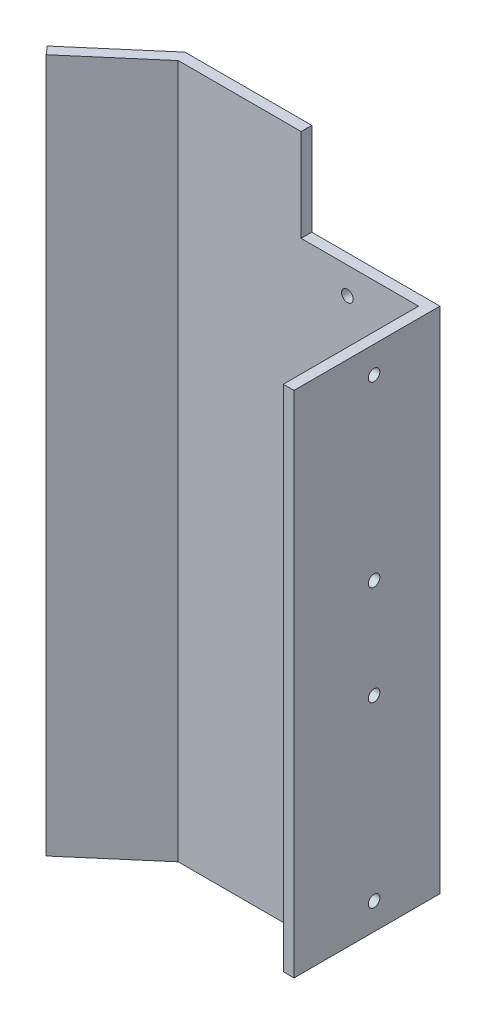
ISO-10303-21;
HEADER;
FILE_DESCRIPTION(('STEP AP214'),'2;1');
FILE_NAME('part.step','',(''),(''),'','','');
FILE_SCHEMA(('AUTOMOTIVE_DESIGN { 1 0 10303 214 1 1 1 1 }'));
ENDSEC;
DATA;
#1=APPLICATION_CONTEXT('core data for automotive mechanical design processes');
#2=APPLICATION_PROTOCOL_DEFINITION('international standard','automotive_design',2000,#1);
#3=PRODUCT_CONTEXT('',#1,'mechanical');
#4=PRODUCT('Part','Part','',(#3));
#5=PRODUCT_RELATED_PRODUCT_CATEGORY('part','',(#4));
#6=PRODUCT_DEFINITION_FORMATION('','',#4);
#7=PRODUCT_DEFINITION_CONTEXT('part definition',#1,'design');
#8=PRODUCT_DEFINITION('design','',#6,#7);
#9=PRODUCT_DEFINITION_SHAPE('','',#8);
#10=(LENGTH_UNIT() NAMED_UNIT(*) SI_UNIT(.MILLI.,.METRE.));
#11=(NAMED_UNIT(*) PLANE_ANGLE_UNIT() SI_UNIT($,.RADIAN.));
#12=(NAMED_UNIT(*) SI_UNIT($,.STERADIAN.) SOLID_ANGLE_UNIT());
#13=UNCERTAINTY_MEASURE_WITH_UNIT(LENGTH_MEASURE(1.E-05),#10,'distance_accuracy_value','');
#14=(GEOMETRIC_REPRESENTATION_CONTEXT(3) GLOBAL_UNCERTAINTY_ASSIGNED_CONTEXT((#13)) GLOBAL_UNIT_ASSIGNED_CONTEXT((#10,
#11,#12)) REPRESENTATION_CONTEXT('',''));
#15=CARTESIAN_POINT('',(0.,0.,0.));
#16=DIRECTION('',(0.,0.,1.));
#17=DIRECTION('',(1.,0.,0.));
#18=AXIS2_PLACEMENT_3D('',#15,#16,#17);
#19=CARTESIAN_POINT('',(0.,143.,-35.5));
#20=DIRECTION('',(0.,0.,1.));
#21=DIRECTION('',(1.,0.,0.));
#22=AXIS2_PLACEMENT_3D('',#19,#20,#21);
#23=PLANE('',#22);
#24=DIRECTION('',(0.,1.,0.));
#25=VECTOR('',#24,1.);
#26=CARTESIAN_POINT('',(-53.5954026543314,-26.,-35.5));
#27=LINE('',#26,#25);
#28=CARTESIAN_POINT('',(-53.5954026543314,-26.,-35.5));
#29=VERTEX_POINT('',#28);
#30=CARTESIAN_POINT('',(-53.5954026543314,143.,-35.5));
#31=VERTEX_POINT('',#30);
#32=EDGE_CURVE('E240',#29,#31,#27,.T.);
#33=ORIENTED_EDGE('',*,*,#32,.T.);
#34=DIRECTION('',(-1.,0.,0.));
#35=VECTOR('',#34,1.);
#36=CARTESIAN_POINT('',(0.,143.,-35.5));
#37=LINE('',#36,#35);
#38=CARTESIAN_POINT('',(-53.6,143.,-35.5));
#39=VERTEX_POINT('',#38);
#40=EDGE_CURVE('E275',#31,#39,#37,.T.);
#41=ORIENTED_EDGE('',*,*,#40,.T.);
#42=DIRECTION('',(0.,-1.,0.));
#43=VECTOR('',#42,1.);
#44=CARTESIAN_POINT('',(-53.6,143.,-35.5));
#45=LINE('',#44,#43);
#46=CARTESIAN_POINT('',(-53.6,-26.,-35.5));
#47=VERTEX_POINT('',#46);
#48=EDGE_CURVE('E48',#39,#47,#45,.T.);
#49=ORIENTED_EDGE('',*,*,#48,.T.);
#50=DIRECTION('',(-1.,0.,0.));
#51=VECTOR('',#50,1.);
#52=CARTESIAN_POINT('',(0.,-26.,-35.5));
#53=LINE('',#52,#51);
#54=EDGE_CURVE('E284',#29,#47,#53,.T.);
#55=ORIENTED_EDGE('',*,*,#54,.F.);
#56=EDGE_LOOP('',(#33,#41,#49,#55));
#57=FACE_BOUND('',#56,.T.);
#58=ADVANCED_FACE('F40',(#57),#23,.T.);
#59=CARTESIAN_POINT('',(0.,0.,0.));
#60=DIRECTION('',(0.,1.,0.));
#61=DIRECTION('',(0.,0.,1.));
#62=AXIS2_PLACEMENT_3D('',#59,#60,#61);
#63=PLANE('',#62);
#64=DIRECTION('',(0.,0.,-1.));
#65=VECTOR('',#64,1.);
#66=CARTESIAN_POINT('',(-16.0000000000001,0.,0.));
#67=LINE('',#66,#65);
#68=CARTESIAN_POINT('',(-16.,0.,-35.5));
#69=VERTEX_POINT('',#68);
#70=CARTESIAN_POINT('',(-16.,0.,-38.5));
#71=VERTEX_POINT('',#70);
#72=EDGE_CURVE('E279',#69,#71,#67,.T.);
#73=ORIENTED_EDGE('',*,*,#72,.T.);
#74=DIRECTION('',(-1.,0.,0.));
#75=VECTOR('',#74,1.);
#76=CARTESIAN_POINT('',(18.,0.,-38.5));
#77=LINE('',#76,#75);
#78=CARTESIAN_POINT('',(20.,0.,-38.5));
#79=VERTEX_POINT('',#78);
#80=EDGE_CURVE('E174',#79,#71,#77,.T.);
#81=ORIENTED_EDGE('',*,*,#80,.F.);
#82=DIRECTION('',(0.,0.,-1.));
#83=VECTOR('',#82,1.);
#84=CARTESIAN_POINT('',(20.,0.,2.5));
#85=LINE('',#84,#83);
#86=CARTESIAN_POINT('',(20.,0.,2.5));
#87=VERTEX_POINT('',#86);
#88=EDGE_CURVE('E171',#87,#79,#85,.T.);
#89=ORIENTED_EDGE('',*,*,#88,.F.);
#90=DIRECTION('',(1.,0.,0.));
#91=VECTOR('',#90,1.);
#92=CARTESIAN_POINT('',(17.,0.,2.5));
#93=LINE('',#92,#91);
#94=CARTESIAN_POINT('',(17.,0.,2.5));
#95=VERTEX_POINT('',#94);
#96=EDGE_CURVE('E160',#95,#87,#93,.T.);
#97=ORIENTED_EDGE('',*,*,#96,.F.);
#98=DIRECTION('',(0.,0.,1.));
#99=VECTOR('',#98,1.);
#100=CARTESIAN_POINT('',(17.,0.,0.));
#101=LINE('',#100,#99);
#102=CARTESIAN_POINT('',(17.,0.,-35.5));
#103=VERTEX_POINT('',#102);
#104=EDGE_CURVE('E327',#103,#95,#101,.T.);
#105=ORIENTED_EDGE('',*,*,#104,.F.);
#106=DIRECTION('',(-1.,0.,0.));
#107=VECTOR('',#106,1.);
#108=CARTESIAN_POINT('',(0.,0.,-35.5));
#109=LINE('',#108,#107);
#110=EDGE_CURVE('E55',#103,#69,#109,.T.);
#111=ORIENTED_EDGE('',*,*,#110,.T.);
#112=EDGE_LOOP('',(#73,#81,#89,#97,#105,#111));
#113=FACE_BOUND('',#112,.T.);
#114=ADVANCED_FACE('F172',(#113),#63,.F.);
#115=CARTESIAN_POINT('',(-40.89180757553,143.,-47.7092905241441));
#116=DIRECTION('',(0.650774217265852,0.,0.75927130733488));
#117=DIRECTION('',(0.75927130733488,0.,-0.650774217265852));
#118=AXIS2_PLACEMENT_3D('',#115,#116,#117);
#119=PLANE('',#118);
#120=DIRECTION('',(0.759271307334879,0.,-0.650774217265853));
#121=VECTOR('',#120,1.);
#122=CARTESIAN_POINT('',(-67.9176577492937,169.,-24.5453353965495));
#123=LINE('',#122,#121);
#124=CARTESIAN_POINT('',(-72.4732855933029,169.,-20.6406900929544));
#125=VERTEX_POINT('',#124);
#126=CARTESIAN_POINT('',(-51.6364711936911,169.,-38.5));
#127=VERTEX_POINT('',#126);
#128=EDGE_CURVE('E290',#125,#127,#123,.T.);
#129=ORIENTED_EDGE('',*,*,#128,.T.);
#130=DIRECTION('',(0.,-1.,0.));
#131=VECTOR('',#130,1.);
#132=CARTESIAN_POINT('',(-51.6364711936911,169.,-38.5));
#133=LINE('',#132,#131);
#134=CARTESIAN_POINT('',(-51.6364711936911,-26.,-38.5));
#135=VERTEX_POINT('',#134);
#136=EDGE_CURVE('E194',#127,#135,#133,.T.);
#137=ORIENTED_EDGE('',*,*,#136,.T.);
#138=DIRECTION('',(-0.759271307334879,0.,0.650774217265853));
#139=VECTOR('',#138,1.);
#140=CARTESIAN_POINT('',(-67.9176577492937,-26.,-24.5453353965495));
#141=LINE('',#140,#139);
#142=CARTESIAN_POINT('',(-72.4732855933029,-26.,-20.6406900929544));
#143=VERTEX_POINT('',#142);
#144=EDGE_CURVE('E294',#135,#143,#141,.T.);
#145=ORIENTED_EDGE('',*,*,#144,.T.);
#146=DIRECTION('',(0.,1.,0.));
#147=VECTOR('',#146,1.);
#148=CARTESIAN_POINT('',(-72.4732855933029,-26.,-20.6406900929544));
#149=LINE('',#148,#147);
#150=EDGE_CURVE('E232',#143,#125,#149,.T.);
#151=ORIENTED_EDGE('',*,*,#150,.T.);
#152=EDGE_LOOP('',(#129,#137,#145,#151));
#153=FACE_BOUND('',#152,.T.);
#154=ADVANCED_FACE('F42',(#153),#119,.F.);
#155=CARTESIAN_POINT('',(-40.2410333582642,143.,-46.9500192168092));
#156=DIRECTION('',(-0.650774217265852,0.,-0.75927130733488));
#157=DIRECTION('',(-0.75927130733488,0.,0.650774217265852));
#158=AXIS2_PLACEMENT_3D('',#155,#156,#157);
#159=PLANE('',#158);
#160=DIRECTION('',(0.75927130733488,0.,-0.650774217265852));
#161=VECTOR('',#160,1.);
#162=CARTESIAN_POINT('',(-40.2410333582642,143.,-46.9500192168092));
#163=LINE('',#162,#161);
#164=CARTESIAN_POINT('',(-67.2668835320279,143.,-23.7860640892146));
#165=VERTEX_POINT('',#164);
#166=EDGE_CURVE('E273',#165,#39,#163,.T.);
#167=ORIENTED_EDGE('',*,*,#166,.F.);
#168=DIRECTION('',(0.,1.,0.));
#169=VECTOR('',#168,1.);
#170=CARTESIAN_POINT('',(-67.2668835320278,143.,-23.7860640892146));
#171=LINE('',#170,#169);
#172=CARTESIAN_POINT('',(-67.2668835320278,169.,-23.7860640892146));
#173=VERTEX_POINT('',#172);
#174=EDGE_CURVE('E270',#165,#173,#171,.T.);
#175=ORIENTED_EDGE('',*,*,#174,.T.);
#176=DIRECTION('',(0.759271307334879,0.,-0.650774217265853));
#177=VECTOR('',#176,1.);
#178=CARTESIAN_POINT('',(-67.2668835320278,169.,-23.7860640892146));
#179=LINE('',#178,#177);
#180=CARTESIAN_POINT('',(-71.0632400687022,169.,-20.5321930028854));
#181=VERTEX_POINT('',#180);
#182=EDGE_CURVE('E291',#181,#173,#179,.T.);
#183=ORIENTED_EDGE('',*,*,#182,.F.);
#184=DIRECTION('',(0.,-1.,0.));
#185=VECTOR('',#184,1.);
#186=CARTESIAN_POINT('',(-71.0632400687022,143.,-20.5321930028854));
#187=LINE('',#186,#185);
#188=CARTESIAN_POINT('',(-71.0632400687022,-26.,-20.5321930028854));
#189=VERTEX_POINT('',#188);
#190=EDGE_CURVE('E11',#181,#189,#187,.T.);
#191=ORIENTED_EDGE('',*,*,#190,.T.);
#192=DIRECTION('',(-0.759271307334879,0.,0.650774217265853));
#193=VECTOR('',#192,1.);
#194=CARTESIAN_POINT('',(-67.2668835320278,-26.,-23.7860640892146));
#195=LINE('',#194,#193);
#196=EDGE_CURVE('E296',#47,#189,#195,.T.);
#197=ORIENTED_EDGE('',*,*,#196,.F.);
#198=ORIENTED_EDGE('',*,*,#48,.F.);
#199=EDGE_LOOP('',(#167,#175,#183,#191,#197,#198));
#200=FACE_BOUND('',#199,.T.);
#201=ADVANCED_FACE('F339',(#200),#159,.F.);
#202=DIRECTION('',(0.,1.,0.));
#203=VECTOR('',#202,1.);
#204=CARTESIAN_POINT('',(-50.526737496758,-26.,-35.5));
#205=LINE('',#204,#203);
#206=CARTESIAN_POINT('',(-50.526737496758,-26.,-35.5));
#207=VERTEX_POINT('',#206);
#208=CARTESIAN_POINT('',(-50.526737496758,169.,-35.5));
#209=VERTEX_POINT('',#208);
#210=EDGE_CURVE('E244',#207,#209,#205,.T.);
#211=ORIENTED_EDGE('',*,*,#210,.F.);
#212=CARTESIAN_POINT('',(-16.,-26.,-35.5));
#213=VERTEX_POINT('',#212);
#214=EDGE_CURVE('E282',#213,#207,#53,.T.);
#215=ORIENTED_EDGE('',*,*,#214,.F.);
#216=DIRECTION('',(0.,-1.,0.));
#217=VECTOR('',#216,1.);
#218=CARTESIAN_POINT('',(-16.,0.,-35.5));
#219=LINE('',#218,#217);
#220=EDGE_CURVE('E281',#69,#213,#219,.T.);
#221=ORIENTED_EDGE('',*,*,#220,.F.);
#222=ORIENTED_EDGE('',*,*,#110,.F.);
#223=DIRECTION('',(0.,-1.,0.));
#224=VECTOR('',#223,1.);
#225=CARTESIAN_POINT('',(17.,143.,-35.5));
#226=LINE('',#225,#224);
#227=CARTESIAN_POINT('',(17.,143.,-35.5));
#228=VERTEX_POINT('',#227);
#229=EDGE_CURVE('E63',#228,#103,#226,.T.);
#230=ORIENTED_EDGE('',*,*,#229,.F.);
#231=DIRECTION('',(-1.,0.,0.));
#232=VECTOR('',#231,1.);
#233=CARTESIAN_POINT('',(0.,143.,-35.5));
#234=LINE('',#233,#232);
#235=CARTESIAN_POINT('',(-16.,143.,-35.5));
#236=VERTEX_POINT('',#235);
#237=EDGE_CURVE('E324',#228,#236,#234,.T.);
#238=ORIENTED_EDGE('',*,*,#237,.T.);
#239=DIRECTION('',(0.,1.,0.));
#240=VECTOR('',#239,1.);
#241=CARTESIAN_POINT('',(-16.,143.,-35.5));
#242=LINE('',#241,#240);
#243=CARTESIAN_POINT('',(-16.,169.,-35.5));
#244=VERTEX_POINT('',#243);
#245=EDGE_CURVE('E261',#236,#244,#242,.T.);
#246=ORIENTED_EDGE('',*,*,#245,.T.);
#247=DIRECTION('',(1.,0.,0.));
#248=VECTOR('',#247,1.);
#249=CARTESIAN_POINT('',(-16.,169.,-35.5));
#250=LINE('',#249,#248);
#251=EDGE_CURVE('E264',#209,#244,#250,.T.);
#252=ORIENTED_EDGE('',*,*,#251,.F.);
#253=EDGE_LOOP('',(#211,#215,#221,#222,#230,#238,#246,#252));
#254=FACE_BOUND('',#253,.T.);
#255=CARTESIAN_POINT('',(-3.00000000000002,7.49999999999998,-35.5));
#256=DIRECTION('',(0.,0.,1.));
#257=DIRECTION('',(1.,0.,0.));
#258=AXIS2_PLACEMENT_3D('',#255,#256,#257);
#259=CIRCLE('',#258,1.625);
#260=CARTESIAN_POINT('',(-1.37500000000002,7.49999999999998,-35.5));
#261=VERTEX_POINT('',#260);
#262=EDGE_CURVE('E301',#261,#261,#259,.F.);
#263=ORIENTED_EDGE('',*,*,#262,.T.);
#264=EDGE_LOOP('',(#263));
#265=FACE_BOUND('',#264,.T.);
#266=CARTESIAN_POINT('',(-3.00000000000002,85.5,-35.5));
#267=DIRECTION('',(0.,0.,1.));
#268=DIRECTION('',(1.,0.,0.));
#269=AXIS2_PLACEMENT_3D('',#266,#267,#268);
#270=CIRCLE('',#269,1.625);
#271=CARTESIAN_POINT('',(-1.37500000000002,85.5,-35.5));
#272=VERTEX_POINT('',#271);
#273=EDGE_CURVE('E299',#272,#272,#270,.F.);
#274=ORIENTED_EDGE('',*,*,#273,.T.);
#275=EDGE_LOOP('',(#274));
#276=FACE_BOUND('',#275,.T.);
#277=CARTESIAN_POINT('',(-3.00000000000002,57.5,-35.5));
#278=DIRECTION('',(0.,0.,1.));
#279=DIRECTION('',(1.,0.,0.));
#280=AXIS2_PLACEMENT_3D('',#277,#278,#279);
#281=CIRCLE('',#280,1.625);
#282=CARTESIAN_POINT('',(-1.37500000000002,57.5,-35.5));
#283=VERTEX_POINT('',#282);
#284=EDGE_CURVE('E308',#283,#283,#281,.F.);
#285=ORIENTED_EDGE('',*,*,#284,.T.);
#286=EDGE_LOOP('',(#285));
#287=FACE_BOUND('',#286,.T.);
#288=CARTESIAN_POINT('',(-3.,135.5,-35.5));
#289=DIRECTION('',(0.,0.,1.));
#290=DIRECTION('',(1.,0.,0.));
#291=AXIS2_PLACEMENT_3D('',#288,#289,#290);
#292=CIRCLE('',#291,1.625);
#293=CARTESIAN_POINT('',(-1.375,135.5,-35.5));
#294=VERTEX_POINT('',#293);
#295=EDGE_CURVE('E305',#294,#294,#292,.F.);
#296=ORIENTED_EDGE('',*,*,#295,.T.);
#297=EDGE_LOOP('',(#296));
#298=FACE_BOUND('',#297,.T.);
#299=ADVANCED_FACE('F368',(#254,#265,#276,#287,#298),#23,.T.);
#300=CARTESIAN_POINT('',(17.,143.,0.));
#301=DIRECTION('',(1.,0.,0.));
#302=DIRECTION('',(0.,0.,-1.));
#303=AXIS2_PLACEMENT_3D('',#300,#301,#302);
#304=PLANE('',#303);
#305=CARTESIAN_POINT('',(17.,135.5,-20.));
#306=DIRECTION('',(1.,0.,0.));
#307=DIRECTION('',(0.,0.,-1.));
#308=AXIS2_PLACEMENT_3D('',#305,#306,#307);
#309=CIRCLE('',#308,1.625);
#310=CARTESIAN_POINT('',(17.,135.5,-21.625));
#311=VERTEX_POINT('',#310);
#312=EDGE_CURVE('E313',#311,#311,#309,.F.);
#313=ORIENTED_EDGE('',*,*,#312,.F.);
#314=EDGE_LOOP('',(#313));
#315=FACE_BOUND('',#314,.T.);
#316=CARTESIAN_POINT('',(17.,57.5,-20.));
#317=DIRECTION('',(1.,0.,0.));
#318=DIRECTION('',(0.,0.,-1.));
#319=AXIS2_PLACEMENT_3D('',#316,#317,#318);
#320=CIRCLE('',#319,1.625);
#321=CARTESIAN_POINT('',(17.,57.5,-21.625));
#322=VERTEX_POINT('',#321);
#323=EDGE_CURVE('E304',#322,#322,#320,.F.);
#324=ORIENTED_EDGE('',*,*,#323,.F.);
#325=EDGE_LOOP('',(#324));
#326=FACE_BOUND('',#325,.T.);
#327=CARTESIAN_POINT('',(17.,85.5,-20.));
#328=DIRECTION('',(1.,0.,0.));
#329=DIRECTION('',(0.,0.,-1.));
#330=AXIS2_PLACEMENT_3D('',#327,#328,#329);
#331=CIRCLE('',#330,1.625);
#332=CARTESIAN_POINT('',(17.,85.5,-21.625));
#333=VERTEX_POINT('',#332);
#334=EDGE_CURVE('E319',#333,#333,#331,.F.);
#335=ORIENTED_EDGE('',*,*,#334,.F.);
#336=EDGE_LOOP('',(#335));
#337=FACE_BOUND('',#336,.T.);
#338=CARTESIAN_POINT('',(17.,7.49999999999998,-20.));
#339=DIRECTION('',(1.,0.,0.));
#340=DIRECTION('',(0.,0.,-1.));
#341=AXIS2_PLACEMENT_3D('',#338,#339,#340);
#342=CIRCLE('',#341,1.625);
#343=CARTESIAN_POINT('',(17.,7.49999999999998,-21.625));
#344=VERTEX_POINT('',#343);
#345=EDGE_CURVE('E316',#344,#344,#342,.F.);
#346=ORIENTED_EDGE('',*,*,#345,.F.);
#347=EDGE_LOOP('',(#346));
#348=FACE_BOUND('',#347,.T.);
#349=ORIENTED_EDGE('',*,*,#104,.T.);
#350=DIRECTION('',(0.,-1.,0.));
#351=VECTOR('',#350,1.);
#352=CARTESIAN_POINT('',(17.,143.,2.5));
#353=LINE('',#352,#351);
#354=CARTESIAN_POINT('',(17.,143.,2.5));
#355=VERTEX_POINT('',#354);
#356=EDGE_CURVE('E167',#355,#95,#353,.T.);
#357=ORIENTED_EDGE('',*,*,#356,.F.);
#358=DIRECTION('',(0.,0.,1.));
#359=VECTOR('',#358,1.);
#360=CARTESIAN_POINT('',(17.,143.,0.));
#361=LINE('',#360,#359);
#362=EDGE_CURVE('E326',#228,#355,#361,.T.);
#363=ORIENTED_EDGE('',*,*,#362,.F.);
#364=ORIENTED_EDGE('',*,*,#229,.T.);
#365=EDGE_LOOP('',(#349,#357,#363,#364));
#366=FACE_BOUND('',#365,.T.);
#367=ADVANCED_FACE('F375',(#315,#326,#337,#348,#366),#304,.F.);
#368=CARTESIAN_POINT('',(0.,143.,0.));
#369=DIRECTION('',(0.,1.,0.));
#370=DIRECTION('',(0.,0.,1.));
#371=AXIS2_PLACEMENT_3D('',#368,#369,#370);
#372=PLANE('',#371);
#373=DIRECTION('',(0.,0.,-1.));
#374=VECTOR('',#373,1.);
#375=CARTESIAN_POINT('',(-16.,143.,-36.5));
#376=LINE('',#375,#374);
#377=CARTESIAN_POINT('',(-16.,143.,-38.5));
#378=VERTEX_POINT('',#377);
#379=EDGE_CURVE('E258',#236,#378,#376,.T.);
#380=ORIENTED_EDGE('',*,*,#379,.F.);
#381=ORIENTED_EDGE('',*,*,#237,.F.);
#382=ORIENTED_EDGE('',*,*,#362,.T.);
#383=DIRECTION('',(-1.,0.,0.));
#384=VECTOR('',#383,1.);
#385=CARTESIAN_POINT('',(17.,143.,2.5));
#386=LINE('',#385,#384);
#387=CARTESIAN_POINT('',(20.,143.,2.5));
#388=VERTEX_POINT('',#387);
#389=EDGE_CURVE('E168',#388,#355,#386,.T.);
#390=ORIENTED_EDGE('',*,*,#389,.F.);
#391=DIRECTION('',(0.,0.,1.));
#392=VECTOR('',#391,1.);
#393=CARTESIAN_POINT('',(20.,143.,2.5));
#394=LINE('',#393,#392);
#395=CARTESIAN_POINT('',(20.,143.,-38.5));
#396=VERTEX_POINT('',#395);
#397=EDGE_CURVE('E184',#396,#388,#394,.T.);
#398=ORIENTED_EDGE('',*,*,#397,.F.);
#399=DIRECTION('',(1.,0.,0.));
#400=VECTOR('',#399,1.);
#401=CARTESIAN_POINT('',(-16.,143.,-38.5));
#402=LINE('',#401,#400);
#403=EDGE_CURVE('E221',#378,#396,#402,.T.);
#404=ORIENTED_EDGE('',*,*,#403,.F.);
#405=EDGE_LOOP('',(#380,#381,#382,#390,#398,#404));
#406=FACE_BOUND('',#405,.T.);
#407=ADVANCED_FACE('F380',(#406),#372,.T.);
#408=CARTESIAN_POINT('',(-71.7150142859681,7.49999999999998,-20.));
#409=DIRECTION('',(1.,0.,0.));
#410=DIRECTION('',(0.,0.,-1.));
#411=AXIS2_PLACEMENT_3D('',#408,#409,#410);
#412=CYLINDRICAL_SURFACE('',#411,1.625);
#413=ORIENTED_EDGE('',*,*,#345,.T.);
#414=EDGE_LOOP('',(#413));
#415=FACE_BOUND('',#414,.T.);
#416=CARTESIAN_POINT('',(20.,7.49999999999998,-20.));
#417=DIRECTION('',(1.,0.,0.));
#418=DIRECTION('',(0.,0.,-1.));
#419=AXIS2_PLACEMENT_3D('',#416,#417,#418);
#420=CIRCLE('',#419,1.625);
#421=CARTESIAN_POINT('',(20.,7.49999999999998,-21.625));
#422=VERTEX_POINT('',#421);
#423=EDGE_CURVE('E185',#422,#422,#420,.T.);
#424=ORIENTED_EDGE('',*,*,#423,.T.);
#425=EDGE_LOOP('',(#424));
#426=FACE_BOUND('',#425,.T.);
#427=ADVANCED_FACE('F538',(#415,#426),#412,.F.);
#428=CARTESIAN_POINT('',(-71.7150142859681,85.5,-20.));
#429=DIRECTION('',(1.,0.,0.));
#430=DIRECTION('',(0.,0.,-1.));
#431=AXIS2_PLACEMENT_3D('',#428,#429,#430);
#432=CYLINDRICAL_SURFACE('',#431,1.625);
#433=ORIENTED_EDGE('',*,*,#334,.T.);
#434=EDGE_LOOP('',(#433));
#435=FACE_BOUND('',#434,.T.);
#436=CARTESIAN_POINT('',(20.,85.5,-20.));
#437=DIRECTION('',(1.,0.,0.));
#438=DIRECTION('',(0.,0.,-1.));
#439=AXIS2_PLACEMENT_3D('',#436,#437,#438);
#440=CIRCLE('',#439,1.625);
#441=CARTESIAN_POINT('',(20.,85.5,-21.625));
#442=VERTEX_POINT('',#441);
#443=EDGE_CURVE('E741',#442,#442,#440,.T.);
#444=ORIENTED_EDGE('',*,*,#443,.T.);
#445=EDGE_LOOP('',(#444));
#446=FACE_BOUND('',#445,.T.);
#447=ADVANCED_FACE('F548',(#435,#446),#432,.F.);
#448=CARTESIAN_POINT('',(-71.7150142859681,57.5,-20.));
#449=DIRECTION('',(1.,0.,0.));
#450=DIRECTION('',(0.,0.,-1.));
#451=AXIS2_PLACEMENT_3D('',#448,#449,#450);
#452=CYLINDRICAL_SURFACE('',#451,1.625);
#453=ORIENTED_EDGE('',*,*,#323,.T.);
#454=EDGE_LOOP('',(#453));
#455=FACE_BOUND('',#454,.T.);
#456=CARTESIAN_POINT('',(20.,57.5,-20.));
#457=DIRECTION('',(1.,0.,0.));
#458=DIRECTION('',(0.,0.,-1.));
#459=AXIS2_PLACEMENT_3D('',#456,#457,#458);
#460=CIRCLE('',#459,1.625);
#461=CARTESIAN_POINT('',(20.,57.5,-21.625));
#462=VERTEX_POINT('',#461);
#463=EDGE_CURVE('E188',#462,#462,#460,.T.);
#464=ORIENTED_EDGE('',*,*,#463,.T.);
#465=EDGE_LOOP('',(#464));
#466=FACE_BOUND('',#465,.T.);
#467=ADVANCED_FACE('F559',(#455,#466),#452,.F.);
#468=CARTESIAN_POINT('',(-71.7150142859681,135.5,-20.));
#469=DIRECTION('',(1.,0.,0.));
#470=DIRECTION('',(0.,0.,-1.));
#471=AXIS2_PLACEMENT_3D('',#468,#469,#470);
#472=CYLINDRICAL_SURFACE('',#471,1.625);
#473=ORIENTED_EDGE('',*,*,#312,.T.);
#474=EDGE_LOOP('',(#473));
#475=FACE_BOUND('',#474,.T.);
#476=CARTESIAN_POINT('',(20.,135.5,-20.));
#477=DIRECTION('',(1.,0.,0.));
#478=DIRECTION('',(0.,0.,-1.));
#479=AXIS2_PLACEMENT_3D('',#476,#477,#478);
#480=CIRCLE('',#479,1.62500000000001);
#481=CARTESIAN_POINT('',(20.,135.5,-21.625));
#482=VERTEX_POINT('',#481);
#483=EDGE_CURVE('E739',#482,#482,#480,.T.);
#484=ORIENTED_EDGE('',*,*,#483,.T.);
#485=EDGE_LOOP('',(#484));
#486=FACE_BOUND('',#485,.T.);
#487=ADVANCED_FACE('F398',(#475,#486),#472,.F.);
#488=CARTESIAN_POINT('',(-3.00000000000001,135.5,0.00100000000002182));
#489=DIRECTION('',(0.,0.,-1.));
#490=DIRECTION('',(-1.,0.,0.));
#491=AXIS2_PLACEMENT_3D('',#488,#489,#490);
#492=CYLINDRICAL_SURFACE('',#491,1.625);
#493=ORIENTED_EDGE('',*,*,#295,.F.);
#494=EDGE_LOOP('',(#493));
#495=FACE_BOUND('',#494,.T.);
#496=CARTESIAN_POINT('',(-3.,135.5,-38.5));
#497=DIRECTION('',(0.,0.,-1.));
#498=DIRECTION('',(-1.,0.,0.));
#499=AXIS2_PLACEMENT_3D('',#496,#497,#498);
#500=CIRCLE('',#499,1.625);
#501=CARTESIAN_POINT('',(-4.625,135.5,-38.5));
#502=VERTEX_POINT('',#501);
#503=EDGE_CURVE('E197',#502,#502,#500,.T.);
#504=ORIENTED_EDGE('',*,*,#503,.T.);
#505=EDGE_LOOP('',(#504));
#506=FACE_BOUND('',#505,.T.);
#507=ADVANCED_FACE('F394',(#495,#506),#492,.F.);
#508=CARTESIAN_POINT('',(-3.00000000000003,57.5,0.00100000000002182));
#509=DIRECTION('',(0.,0.,-1.));
#510=DIRECTION('',(-1.,0.,0.));
#511=AXIS2_PLACEMENT_3D('',#508,#509,#510);
#512=CYLINDRICAL_SURFACE('',#511,1.625);
#513=ORIENTED_EDGE('',*,*,#284,.F.);
#514=EDGE_LOOP('',(#513));
#515=FACE_BOUND('',#514,.T.);
#516=CARTESIAN_POINT('',(-3.00000000000002,57.5,-38.5));
#517=DIRECTION('',(0.,0.,-1.));
#518=DIRECTION('',(-1.,0.,0.));
#519=AXIS2_PLACEMENT_3D('',#516,#517,#518);
#520=CIRCLE('',#519,1.625);
#521=CARTESIAN_POINT('',(-4.62500000000002,57.5,-38.5));
#522=VERTEX_POINT('',#521);
#523=EDGE_CURVE('E203',#522,#522,#520,.T.);
#524=ORIENTED_EDGE('',*,*,#523,.T.);
#525=EDGE_LOOP('',(#524));
#526=FACE_BOUND('',#525,.T.);
#527=ADVANCED_FACE('F397',(#515,#526),#512,.F.);
#528=CARTESIAN_POINT('',(-3.00000000000003,85.5,0.00100000000002182));
#529=DIRECTION('',(0.,0.,-1.));
#530=DIRECTION('',(-1.,0.,0.));
#531=AXIS2_PLACEMENT_3D('',#528,#529,#530);
#532=CYLINDRICAL_SURFACE('',#531,1.625);
#533=ORIENTED_EDGE('',*,*,#273,.F.);
#534=EDGE_LOOP('',(#533));
#535=FACE_BOUND('',#534,.T.);
#536=CARTESIAN_POINT('',(-3.00000000000002,85.5,-38.5));
#537=DIRECTION('',(0.,0.,-1.));
#538=DIRECTION('',(-1.,0.,0.));
#539=AXIS2_PLACEMENT_3D('',#536,#537,#538);
#540=CIRCLE('',#539,1.625);
#541=CARTESIAN_POINT('',(-4.62500000000002,85.5,-38.5));
#542=VERTEX_POINT('',#541);
#543=EDGE_CURVE('E200',#542,#542,#540,.T.);
#544=ORIENTED_EDGE('',*,*,#543,.T.);
#545=EDGE_LOOP('',(#544));
#546=FACE_BOUND('',#545,.T.);
#547=ADVANCED_FACE('F455',(#535,#546),#532,.F.);
#548=CARTESIAN_POINT('',(-3.00000000000003,7.49999999999998,0.00100000000002182));
#549=DIRECTION('',(0.,0.,-1.));
#550=DIRECTION('',(-1.,0.,0.));
#551=AXIS2_PLACEMENT_3D('',#548,#549,#550);
#552=CYLINDRICAL_SURFACE('',#551,1.625);
#553=ORIENTED_EDGE('',*,*,#262,.F.);
#554=EDGE_LOOP('',(#553));
#555=FACE_BOUND('',#554,.T.);
#556=CARTESIAN_POINT('',(-3.00000000000002,7.49999999999998,-38.5));
#557=DIRECTION('',(0.,0.,-1.));
#558=DIRECTION('',(-1.,0.,0.));
#559=AXIS2_PLACEMENT_3D('',#556,#557,#558);
#560=CIRCLE('',#559,1.625);
#561=CARTESIAN_POINT('',(-4.62500000000002,7.49999999999998,-38.5));
#562=VERTEX_POINT('',#561);
#563=EDGE_CURVE('E206',#562,#562,#560,.T.);
#564=ORIENTED_EDGE('',*,*,#563,.T.);
#565=EDGE_LOOP('',(#564));
#566=FACE_BOUND('',#565,.T.);
#567=ADVANCED_FACE('F466',(#555,#566),#552,.F.);
#568=CARTESIAN_POINT('',(-67.2668835320278,-26.,-23.7860640892146));
#569=DIRECTION('',(0.,-1.,0.));
#570=DIRECTION('',(0.,0.,-1.));
#571=AXIS2_PLACEMENT_3D('',#568,#569,#570);
#572=PLANE('',#571);
#573=ORIENTED_EDGE('',*,*,#144,.F.);
#574=DIRECTION('',(-1.,0.,0.));
#575=VECTOR('',#574,1.);
#576=CARTESIAN_POINT('',(-16.,-26.,-38.5));
#577=LINE('',#576,#575);
#578=CARTESIAN_POINT('',(-16.,-26.,-38.5));
#579=VERTEX_POINT('',#578);
#580=EDGE_CURVE('E213',#579,#135,#577,.T.);
#581=ORIENTED_EDGE('',*,*,#580,.F.);
#582=DIRECTION('',(0.,0.,-1.));
#583=VECTOR('',#582,1.);
#584=CARTESIAN_POINT('',(-16.0000000000001,-26.,0.));
#585=LINE('',#584,#583);
#586=EDGE_CURVE('E278',#213,#579,#585,.T.);
#587=ORIENTED_EDGE('',*,*,#586,.F.);
#588=ORIENTED_EDGE('',*,*,#214,.T.);
#589=DIRECTION('',(0.759271307334874,0.,-0.650774217265858));
#590=VECTOR('',#589,1.);
#591=CARTESIAN_POINT('',(-70.5209629415054,-26.,-18.3628761709498));
#592=LINE('',#591,#590);
#593=CARTESIAN_POINT('',(-70.5209629415054,-26.,-18.3628761709498));
#594=VERTEX_POINT('',#593);
#595=EDGE_CURVE('E230',#594,#207,#592,.T.);
#596=ORIENTED_EDGE('',*,*,#595,.F.);
#597=DIRECTION('',(0.650774217265852,0.,0.75927130733488));
#598=VECTOR('',#597,1.);
#599=CARTESIAN_POINT('',(-72.4732855933029,-26.,-20.6406900929544));
#600=LINE('',#599,#598);
#601=EDGE_CURVE('E227',#143,#594,#600,.T.);
#602=ORIENTED_EDGE('',*,*,#601,.F.);
#603=EDGE_LOOP('',(#573,#581,#587,#588,#596,#602));
#604=FACE_BOUND('',#603,.T.);
#605=DIRECTION('',(-0.759355940608151,0.,0.650675460935104));
#606=VECTOR('',#605,1.);
#607=CARTESIAN_POINT('',(-71.0632400687022,-26.,-20.5321930028854));
#608=LINE('',#607,#606);
#609=EDGE_CURVE('E224',#29,#189,#608,.T.);
#610=ORIENTED_EDGE('',*,*,#609,.F.);
#611=ORIENTED_EDGE('',*,*,#54,.T.);
#612=ORIENTED_EDGE('',*,*,#196,.T.);
#613=EDGE_LOOP('',(#610,#611,#612));
#614=FACE_BOUND('',#613,.T.);
#615=ADVANCED_FACE('F343',(#604,#614),#572,.T.);
#616=CARTESIAN_POINT('',(-67.2668835320278,169.,-23.7860640892146));
#617=DIRECTION('',(0.,1.,0.));
#618=DIRECTION('',(0.,0.,1.));
#619=AXIS2_PLACEMENT_3D('',#616,#617,#618);
#620=PLANE('',#619);
#621=DIRECTION('',(1.,0.,0.));
#622=VECTOR('',#621,1.);
#623=CARTESIAN_POINT('',(-53.9699112323111,169.,-38.5));
#624=LINE('',#623,#622);
#625=CARTESIAN_POINT('',(-16.,169.,-38.5));
#626=VERTEX_POINT('',#625);
#627=EDGE_CURVE('E216',#127,#626,#624,.T.);
#628=ORIENTED_EDGE('',*,*,#627,.F.);
#629=ORIENTED_EDGE('',*,*,#128,.F.);
#630=DIRECTION('',(0.65077421726586,0.,0.759271307334873));
#631=VECTOR('',#630,1.);
#632=CARTESIAN_POINT('',(-71.8225113760371,169.,-19.8814187856195));
#633=LINE('',#632,#631);
#634=CARTESIAN_POINT('',(-70.5209629415054,169.,-18.3628761709498));
#635=VERTEX_POINT('',#634);
#636=EDGE_CURVE('E235',#125,#635,#633,.T.);
#637=ORIENTED_EDGE('',*,*,#636,.T.);
#638=DIRECTION('',(0.759271307334874,0.,-0.650774217265858));
#639=VECTOR('',#638,1.);
#640=CARTESIAN_POINT('',(-70.5209629415054,169.,-18.3628761709498));
#641=LINE('',#640,#639);
#642=EDGE_CURVE('E228',#635,#209,#641,.T.);
#643=ORIENTED_EDGE('',*,*,#642,.T.);
#644=ORIENTED_EDGE('',*,*,#251,.T.);
#645=DIRECTION('',(0.,0.,-1.));
#646=VECTOR('',#645,1.);
#647=CARTESIAN_POINT('',(-16.,169.,-36.5));
#648=LINE('',#647,#646);
#649=EDGE_CURVE('E259',#244,#626,#648,.T.);
#650=ORIENTED_EDGE('',*,*,#649,.T.);
#651=EDGE_LOOP('',(#628,#629,#637,#643,#644,#650));
#652=FACE_BOUND('',#651,.T.);
#653=DIRECTION('',(0.650774217265849,0.,0.759271307334883));
#654=VECTOR('',#653,1.);
#655=CARTESIAN_POINT('',(-67.9176577492937,169.,-24.5453353965495));
#656=LINE('',#655,#654);
#657=CARTESIAN_POINT('',(-67.2664603335491,169.,-23.7855703350773));
#658=VERTEX_POINT('',#657);
#659=EDGE_CURVE('E254',#173,#658,#656,.T.);
#660=ORIENTED_EDGE('',*,*,#659,.T.);
#661=DIRECTION('',(-0.759355940608151,0.,0.650675460935104));
#662=VECTOR('',#661,1.);
#663=CARTESIAN_POINT('',(-71.0632400687022,169.,-20.5321930028854));
#664=LINE('',#663,#662);
#665=EDGE_CURVE('E223',#658,#181,#664,.T.);
#666=ORIENTED_EDGE('',*,*,#665,.T.);
#667=ORIENTED_EDGE('',*,*,#182,.T.);
#668=EDGE_LOOP('',(#660,#666,#667));
#669=FACE_BOUND('',#668,.T.);
#670=ADVANCED_FACE('F351',(#652,#669),#620,.T.);
#671=CARTESIAN_POINT('',(0.,0.,2.5));
#672=DIRECTION('',(0.,0.,1.));
#673=DIRECTION('',(1.,0.,0.));
#674=AXIS2_PLACEMENT_3D('',#671,#672,#673);
#675=PLANE('',#674);
#676=ORIENTED_EDGE('',*,*,#356,.T.);
#677=ORIENTED_EDGE('',*,*,#96,.T.);
#678=DIRECTION('',(0.,-1.,0.));
#679=VECTOR('',#678,1.);
#680=CARTESIAN_POINT('',(20.,143.,2.5));
#681=LINE('',#680,#679);
#682=EDGE_CURVE('E165',#388,#87,#681,.T.);
#683=ORIENTED_EDGE('',*,*,#682,.F.);
#684=ORIENTED_EDGE('',*,*,#389,.T.);
#685=EDGE_LOOP('',(#676,#677,#683,#684));
#686=FACE_BOUND('',#685,.T.);
#687=ADVANCED_FACE('F162',(#686),#675,.T.);
#688=CARTESIAN_POINT('',(-16.0000000000001,0.,0.));
#689=DIRECTION('',(-1.,0.,0.));
#690=DIRECTION('',(0.,0.,1.));
#691=AXIS2_PLACEMENT_3D('',#688,#689,#690);
#692=PLANE('',#691);
#693=ORIENTED_EDGE('',*,*,#586,.T.);
#694=DIRECTION('',(0.,-1.,0.));
#695=VECTOR('',#694,1.);
#696=CARTESIAN_POINT('',(-16.,0.,-38.5));
#697=LINE('',#696,#695);
#698=EDGE_CURVE('E210',#71,#579,#697,.T.);
#699=ORIENTED_EDGE('',*,*,#698,.F.);
#700=ORIENTED_EDGE('',*,*,#72,.F.);
#701=ORIENTED_EDGE('',*,*,#220,.T.);
#702=EDGE_LOOP('',(#693,#699,#700,#701));
#703=FACE_BOUND('',#702,.T.);
#704=ADVANCED_FACE('F363',(#703),#692,.F.);
#705=CARTESIAN_POINT('',(0.,143.,0.));
#706=DIRECTION('',(0.,1.,0.));
#707=DIRECTION('',(0.,0.,1.));
#708=AXIS2_PLACEMENT_3D('',#705,#706,#707);
#709=PLANE('',#708);
#710=ORIENTED_EDGE('',*,*,#40,.F.);
#711=DIRECTION('',(-0.759355940608151,0.,0.650675460935104));
#712=VECTOR('',#711,1.);
#713=CARTESIAN_POINT('',(-40.2314909770047,143.,-46.9512429883362));
#714=LINE('',#713,#712);
#715=CARTESIAN_POINT('',(-67.2664603335491,143.,-23.7855703350773));
#716=VERTEX_POINT('',#715);
#717=EDGE_CURVE('E251',#31,#716,#714,.T.);
#718=ORIENTED_EDGE('',*,*,#717,.T.);
#719=DIRECTION('',(0.650774217265849,0.,0.759271307334883));
#720=VECTOR('',#719,1.);
#721=CARTESIAN_POINT('',(-67.9176577492937,143.,-24.5453353965495));
#722=LINE('',#721,#720);
#723=EDGE_CURVE('E255',#165,#716,#722,.T.);
#724=ORIENTED_EDGE('',*,*,#723,.F.);
#725=ORIENTED_EDGE('',*,*,#166,.T.);
#726=EDGE_LOOP('',(#710,#718,#724,#725));
#727=FACE_BOUND('',#726,.T.);
#728=ADVANCED_FACE('F347',(#727),#709,.F.);
#729=CARTESIAN_POINT('',(-67.9176577492937,143.,-24.5453353965495));
#730=DIRECTION('',(-0.759271307334883,0.,0.650774217265849));
#731=DIRECTION('',(0.650774217265849,0.,0.759271307334883));
#732=AXIS2_PLACEMENT_3D('',#729,#730,#731);
#733=PLANE('',#732);
#734=DIRECTION('',(0.,-1.,0.));
#735=VECTOR('',#734,1.);
#736=CARTESIAN_POINT('',(-67.2664603335491,143.,-23.7855703350773));
#737=LINE('',#736,#735);
#738=EDGE_CURVE('E243',#658,#716,#737,.T.);
#739=ORIENTED_EDGE('',*,*,#738,.F.);
#740=ORIENTED_EDGE('',*,*,#659,.F.);
#741=ORIENTED_EDGE('',*,*,#174,.F.);
#742=ORIENTED_EDGE('',*,*,#723,.T.);
#743=EDGE_LOOP('',(#739,#740,#741,#742));
#744=FACE_BOUND('',#743,.T.);
#745=ADVANCED_FACE('F353',(#744),#733,.T.);
#746=CARTESIAN_POINT('',(-16.,143.,-36.5));
#747=DIRECTION('',(1.,0.,0.));
#748=DIRECTION('',(0.,0.,-1.));
#749=AXIS2_PLACEMENT_3D('',#746,#747,#748);
#750=PLANE('',#749);
#751=ORIENTED_EDGE('',*,*,#649,.F.);
#752=ORIENTED_EDGE('',*,*,#245,.F.);
#753=ORIENTED_EDGE('',*,*,#379,.T.);
#754=DIRECTION('',(0.,-1.,0.));
#755=VECTOR('',#754,1.);
#756=CARTESIAN_POINT('',(-16.,169.,-38.5));
#757=LINE('',#756,#755);
#758=EDGE_CURVE('E218',#626,#378,#757,.T.);
#759=ORIENTED_EDGE('',*,*,#758,.F.);
#760=EDGE_LOOP('',(#751,#752,#753,#759));
#761=FACE_BOUND('',#760,.T.);
#762=ADVANCED_FACE('F355',(#761),#750,.T.);
#763=CARTESIAN_POINT('',(-71.0632400687022,-26.,-20.5321930028854));
#764=DIRECTION('',(-0.650675460935104,0.,-0.759355940608151));
#765=DIRECTION('',(-0.759355940608151,0.,0.650675460935104));
#766=AXIS2_PLACEMENT_3D('',#763,#764,#765);
#767=PLANE('',#766);
#768=ORIENTED_EDGE('',*,*,#717,.F.);
#769=ORIENTED_EDGE('',*,*,#32,.F.);
#770=ORIENTED_EDGE('',*,*,#609,.T.);
#771=ORIENTED_EDGE('',*,*,#190,.F.);
#772=ORIENTED_EDGE('',*,*,#665,.F.);
#773=ORIENTED_EDGE('',*,*,#738,.T.);
#774=EDGE_LOOP('',(#768,#769,#770,#771,#772,#773));
#775=FACE_BOUND('',#774,.T.);
#776=ADVANCED_FACE('F345',(#775),#767,.T.);
#777=CARTESIAN_POINT('',(-70.5209629415054,-26.,-18.3628761709498));
#778=DIRECTION('',(0.650774217265858,0.,0.759271307334874));
#779=DIRECTION('',(0.759271307334874,0.,-0.650774217265858));
#780=AXIS2_PLACEMENT_3D('',#777,#778,#779);
#781=PLANE('',#780);
#782=ORIENTED_EDGE('',*,*,#642,.F.);
#783=DIRECTION('',(0.,1.,0.));
#784=VECTOR('',#783,1.);
#785=CARTESIAN_POINT('',(-70.5209629415054,-26.,-18.3628761709498));
#786=LINE('',#785,#784);
#787=EDGE_CURVE('E246',#594,#635,#786,.T.);
#788=ORIENTED_EDGE('',*,*,#787,.F.);
#789=ORIENTED_EDGE('',*,*,#595,.T.);
#790=ORIENTED_EDGE('',*,*,#210,.T.);
#791=EDGE_LOOP('',(#782,#788,#789,#790));
#792=FACE_BOUND('',#791,.T.);
#793=ADVANCED_FACE('F413',(#792),#781,.T.);
#794=CARTESIAN_POINT('',(-71.8225113760371,-26.,-19.8814187856195));
#795=DIRECTION('',(-0.759271307334873,0.,0.65077421726586));
#796=DIRECTION('',(0.65077421726586,0.,0.759271307334873));
#797=AXIS2_PLACEMENT_3D('',#794,#795,#796);
#798=PLANE('',#797);
#799=ORIENTED_EDGE('',*,*,#636,.F.);
#800=ORIENTED_EDGE('',*,*,#150,.F.);
#801=ORIENTED_EDGE('',*,*,#601,.T.);
#802=ORIENTED_EDGE('',*,*,#787,.T.);
#803=EDGE_LOOP('',(#799,#800,#801,#802));
#804=FACE_BOUND('',#803,.T.);
#805=ADVANCED_FACE('F404',(#804),#798,.T.);
#806=CARTESIAN_POINT('',(0.,0.,-38.5));
#807=DIRECTION('',(0.,0.,-1.));
#808=DIRECTION('',(-1.,0.,0.));
#809=AXIS2_PLACEMENT_3D('',#806,#807,#808);
#810=PLANE('',#809);
#811=ORIENTED_EDGE('',*,*,#136,.F.);
#812=ORIENTED_EDGE('',*,*,#627,.T.);
#813=ORIENTED_EDGE('',*,*,#758,.T.);
#814=ORIENTED_EDGE('',*,*,#403,.T.);
#815=DIRECTION('',(0.,1.,0.));
#816=VECTOR('',#815,1.);
#817=CARTESIAN_POINT('',(20.,143.,-38.5));
#818=LINE('',#817,#816);
#819=EDGE_CURVE('E178',#79,#396,#818,.T.);
#820=ORIENTED_EDGE('',*,*,#819,.F.);
#821=ORIENTED_EDGE('',*,*,#80,.T.);
#822=ORIENTED_EDGE('',*,*,#698,.T.);
#823=ORIENTED_EDGE('',*,*,#580,.T.);
#824=EDGE_LOOP('',(#811,#812,#813,#814,#820,#821,#822,#823));
#825=FACE_BOUND('',#824,.T.);
#826=ORIENTED_EDGE('',*,*,#543,.F.);
#827=EDGE_LOOP('',(#826));
#828=FACE_BOUND('',#827,.T.);
#829=ORIENTED_EDGE('',*,*,#563,.F.);
#830=EDGE_LOOP('',(#829));
#831=FACE_BOUND('',#830,.T.);
#832=ORIENTED_EDGE('',*,*,#523,.F.);
#833=EDGE_LOOP('',(#832));
#834=FACE_BOUND('',#833,.T.);
#835=ORIENTED_EDGE('',*,*,#503,.F.);
#836=EDGE_LOOP('',(#835));
#837=FACE_BOUND('',#836,.T.);
#838=ADVANCED_FACE('F402',(#825,#828,#831,#834,#837),#810,.T.);
#839=CARTESIAN_POINT('',(20.,0.,0.));
#840=DIRECTION('',(1.,0.,0.));
#841=DIRECTION('',(0.,0.,-1.));
#842=AXIS2_PLACEMENT_3D('',#839,#840,#841);
#843=PLANE('',#842);
#844=ORIENTED_EDGE('',*,*,#443,.F.);
#845=EDGE_LOOP('',(#844));
#846=FACE_BOUND('',#845,.T.);
#847=ORIENTED_EDGE('',*,*,#423,.F.);
#848=EDGE_LOOP('',(#847));
#849=FACE_BOUND('',#848,.T.);
#850=ORIENTED_EDGE('',*,*,#682,.T.);
#851=ORIENTED_EDGE('',*,*,#88,.T.);
#852=ORIENTED_EDGE('',*,*,#819,.T.);
#853=ORIENTED_EDGE('',*,*,#397,.T.);
#854=EDGE_LOOP('',(#850,#851,#852,#853));
#855=FACE_BOUND('',#854,.T.);
#856=ORIENTED_EDGE('',*,*,#463,.F.);
#857=EDGE_LOOP('',(#856));
#858=FACE_BOUND('',#857,.T.);
#859=ORIENTED_EDGE('',*,*,#483,.F.);
#860=EDGE_LOOP('',(#859));
#861=FACE_BOUND('',#860,.T.);
#862=ADVANCED_FACE('F181',(#846,#849,#855,#858,#861),#843,.T.);
#863=CLOSED_SHELL('',(#58,#114,#154,#201,#299,#367,#407,#427,#447,#467,#487,#507,#527,#547,#567,
#615,#670,#687,#704,#728,#745,#762,#776,#793,#805,#838,#862));
#864=MANIFOLD_SOLID_BREP('B2',#863);
#865=ADVANCED_BREP_SHAPE_REPRESENTATION('',(#18,#864),#14);
#866=SHAPE_DEFINITION_REPRESENTATION(#9,#865);
ENDSEC;
END-ISO-10303-21;
